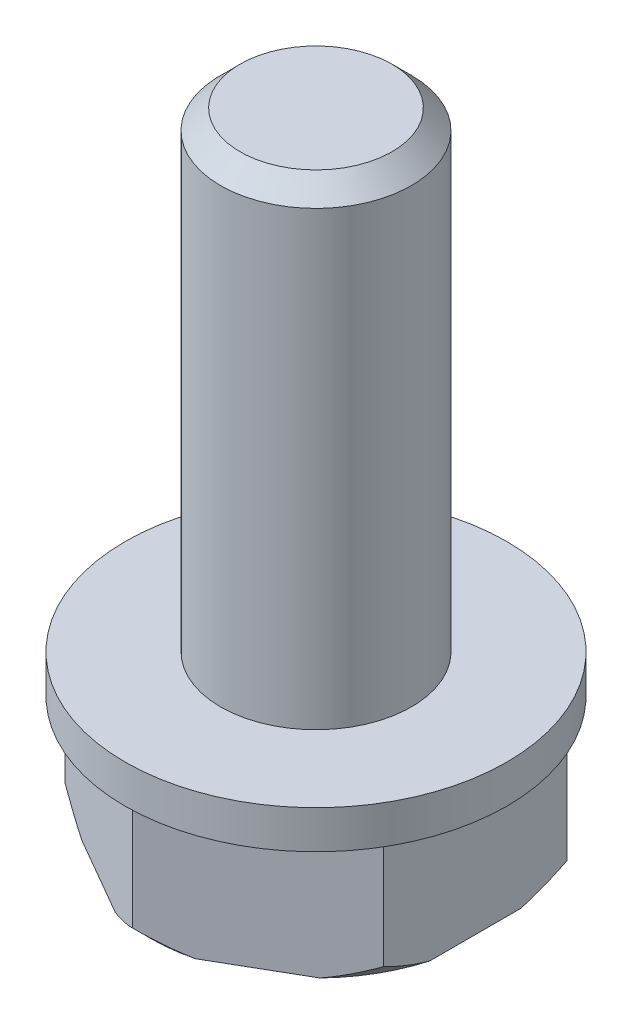
ISO-10303-21;
HEADER;
FILE_DESCRIPTION(('STEP AP214'),'2;1');
FILE_NAME('part.step','',(''),(''),'','','');
FILE_SCHEMA(('AUTOMOTIVE_DESIGN { 1 0 10303 214 1 1 1 1 }'));
ENDSEC;
DATA;
#1=APPLICATION_CONTEXT('core data for automotive mechanical design processes');
#2=APPLICATION_PROTOCOL_DEFINITION('international standard','automotive_design',2000,#1);
#3=PRODUCT_CONTEXT('',#1,'mechanical');
#4=PRODUCT('Part','Part','',(#3));
#5=PRODUCT_RELATED_PRODUCT_CATEGORY('part','',(#4));
#6=PRODUCT_DEFINITION_FORMATION('','',#4);
#7=PRODUCT_DEFINITION_CONTEXT('part definition',#1,'design');
#8=PRODUCT_DEFINITION('design','',#6,#7);
#9=PRODUCT_DEFINITION_SHAPE('','',#8);
#10=(LENGTH_UNIT() NAMED_UNIT(*) SI_UNIT(.MILLI.,.METRE.));
#11=(NAMED_UNIT(*) PLANE_ANGLE_UNIT() SI_UNIT($,.RADIAN.));
#12=(NAMED_UNIT(*) SI_UNIT($,.STERADIAN.) SOLID_ANGLE_UNIT());
#13=UNCERTAINTY_MEASURE_WITH_UNIT(LENGTH_MEASURE(1.E-05),#10,'distance_accuracy_value','');
#14=(GEOMETRIC_REPRESENTATION_CONTEXT(3) GLOBAL_UNCERTAINTY_ASSIGNED_CONTEXT((#13)) GLOBAL_UNIT_ASSIGNED_CONTEXT((#10,
#11,#12)) REPRESENTATION_CONTEXT('',''));
#15=CARTESIAN_POINT('',(0.,0.,0.));
#16=DIRECTION('',(0.,0.,1.));
#17=DIRECTION('',(1.,0.,0.));
#18=AXIS2_PLACEMENT_3D('',#15,#16,#17);
#19=CARTESIAN_POINT('',(22.6776695296637,96.,-20.5644208756118));
#20=DIRECTION('',(-0.5,0.,0.866025403784439));
#21=DIRECTION('',(0.866025403784439,0.,0.5));
#22=AXIS2_PLACEMENT_3D('',#19,#20,#21);
#23=PLANE('',#22);
#24=DIRECTION('',(0.,-1.,0.));
#25=VECTOR('',#24,1.);
#26=CARTESIAN_POINT('',(22.6776695296637,96.,-20.5644208756118));
#27=LINE('',#26,#25);
#28=CARTESIAN_POINT('',(22.6776695296637,50.,-20.5644208756118));
#29=VERTEX_POINT('',#28);
#30=CARTESIAN_POINT('',(22.6776695296637,46.5735026918963,-20.5644208756118));
#31=VERTEX_POINT('',#30);
#32=EDGE_CURVE('E11',#29,#31,#27,.T.);
#33=ORIENTED_EDGE('',*,*,#32,.T.);
#34=CARTESIAN_POINT('',(21.414601217349,46.,-21.2936537057316));
#35=CARTESIAN_POINT('',(21.4664537594648,46.0164440766261,-21.2637151211004));
#36=CARTESIAN_POINT('',(21.5180895158105,46.0337687545802,-21.2338904269128));
#37=CARTESIAN_POINT('',(21.6214874574526,46.0702823086314,-21.1741594018992));
#38=CARTESIAN_POINT('',(21.6732446970938,46.0894897238432,-21.1442558321939));
#39=CARTESIAN_POINT('',(21.7769756621481,46.1297670931507,-21.0843293780453));
#40=CARTESIAN_POINT('',(21.8289432219275,46.1508582920278,-21.054310131997));
#41=CARTESIAN_POINT('',(21.9331790081629,46.1949003649628,-20.9941094242253));
#42=CARTESIAN_POINT('',(21.9854399260141,46.2178745106764,-20.9639323574686));
#43=CARTESIAN_POINT('',(22.0903392794409,46.2656807395659,-20.9033725653862));
#44=CARTESIAN_POINT('',(22.1429693499514,46.2905375181192,-20.8729948770988));
#45=CARTESIAN_POINT('',(22.2486773209186,46.3421079012049,-20.8119895662206));
#46=CARTESIAN_POINT('',(22.3017459168783,46.3688470805479,-20.7813674698508));
#47=CARTESIAN_POINT('',(22.4083946755418,46.4241810640024,-20.7198294215317));
#48=CARTESIAN_POINT('',(22.4619647196343,46.4528018406309,-20.6889193342318));
#49=CARTESIAN_POINT('',(22.56967482855,46.5119007649667,-20.6267615953025));
#50=CARTESIAN_POINT('',(22.6238041115768,46.5424049416879,-20.5955199875061));
#51=CARTESIAN_POINT('',(22.6776695296637,46.5735026918963,-20.5644208756118));
#52=B_SPLINE_CURVE_WITH_KNOTS('',3,(#34,#35,#36,#37,#38,#39,#40,#41,#42,#43,#44,#45,#46,#47,#48,
#49,#50,#51),.UNSPECIFIED.,.F.,.F.,(4,2,2,2,2,2,2,2,4),(0.,0.186265222277086,0.374595608167021,
0.565412784427934,0.759111232115696,0.956057798253864,1.15659171756842,1.36102506604504,
1.56964356219137),.UNSPECIFIED.);
#53=CARTESIAN_POINT('',(21.414601217349,46.,-21.2936537057316));
#54=VERTEX_POINT('',#53);
#55=EDGE_CURVE('E140',#54,#31,#52,.T.);
#56=ORIENTED_EDGE('',*,*,#55,.F.);
#57=DIRECTION('',(0.866025403784439,0.,0.5));
#58=VECTOR('',#57,1.);
#59=CARTESIAN_POINT('',(24.0776695296637,46.,-19.7561304987464));
#60=LINE('',#59,#58);
#61=CARTESIAN_POINT('',(18.9407378419784,46.,-22.7219393914402));
#62=VERTEX_POINT('',#61);
#63=EDGE_CURVE('E158',#62,#54,#60,.T.);
#64=ORIENTED_EDGE('',*,*,#63,.F.);
#65=CARTESIAN_POINT('',(17.6776695296637,46.5735026918963,-23.45117222156));
#66=CARTESIAN_POINT('',(17.7315348596427,46.5424049416879,-23.4200729570583));
#67=CARTESIAN_POINT('',(17.7856555271629,46.5119007649667,-23.3888164267667));
#68=CARTESIAN_POINT('',(17.8933407625753,46.4528018406309,-23.326615605666));
#69=CARTESIAN_POINT('',(17.9468947054565,46.4241810640024,-23.29567763025));
#70=CARTESIAN_POINT('',(18.0535125979319,46.3688470805479,-23.2340861201248));
#71=CARTESIAN_POINT('',(18.1065664092851,46.3421079012049,-23.2034384160655));
#72=CARTESIAN_POINT('',(18.212252543755,46.2905375181192,-23.1423952832645));
#73=CARTESIAN_POINT('',(18.2648754287754,46.2656807395659,-23.1120051493432));
#74=CARTESIAN_POINT('',(18.3697714238801,46.2178745106764,-23.0514395404762));
#75=CARTESIAN_POINT('',(18.4220359892286,46.1949003649628,-23.0212687913703));
#76=CARTESIAN_POINT('',(18.5262892246024,46.1508582920278,-22.9610983063928));
#77=CARTESIAN_POINT('',(18.5782704341725,46.1297670931507,-22.9311027024754));
#78=CARTESIAN_POINT('',(18.682033748351,46.0894897238432,-22.8712322786535));
#79=CARTESIAN_POINT('',(18.7338096192002,46.0702823086314,-22.8413609791471));
#80=CARTESIAN_POINT('',(18.8372371750771,46.0337687545802,-22.7816812474928));
#81=CARTESIAN_POINT('',(18.8888839960765,46.0164440766261,-22.7518757178476));
#82=CARTESIAN_POINT('',(18.9407378419784,46.,-22.7219393914402));
#83=B_SPLINE_CURVE_WITH_KNOTS('',3,(#65,#66,#67,#68,#69,#70,#71,#72,#73,#74,#75,#76,#77,#78,#79,
#80,#81,#82),.UNSPECIFIED.,.F.,.F.,(4,2,2,2,2,2,2,2,4),(0.,0.208618496146344,0.413051844622971,
0.613585763937533,0.810532330075705,1.00423077776347,1.19504795402439,1.38337833991431,
1.56964356219139),.UNSPECIFIED.);
#84=CARTESIAN_POINT('',(17.6776695296637,46.5735026918963,-23.4511722215599));
#85=VERTEX_POINT('',#84);
#86=EDGE_CURVE('E115',#85,#62,#83,.T.);
#87=ORIENTED_EDGE('',*,*,#86,.F.);
#88=DIRECTION('',(0.,-1.,0.));
#89=VECTOR('',#88,1.);
#90=CARTESIAN_POINT('',(17.6776695296637,96.,-23.4511722215599));
#91=LINE('',#90,#89);
#92=CARTESIAN_POINT('',(17.6776695296637,50.,-23.4511722215599));
#93=VERTEX_POINT('',#92);
#94=EDGE_CURVE('E416',#93,#85,#91,.T.);
#95=ORIENTED_EDGE('',*,*,#94,.F.);
#96=DIRECTION('',(-0.866025403784439,0.,-0.5));
#97=VECTOR('',#96,1.);
#98=CARTESIAN_POINT('',(22.4276695296637,50.,-20.7087584429092));
#99=LINE('',#98,#97);
#100=EDGE_CURVE('E384',#29,#93,#99,.T.);
#101=ORIENTED_EDGE('',*,*,#100,.F.);
#102=EDGE_LOOP('',(#33,#56,#64,#87,#95,#101));
#103=FACE_BOUND('',#102,.T.);
#104=ADVANCED_FACE('F16',(#103),#23,.F.);
#105=CARTESIAN_POINT('',(22.6776695296637,96.,-14.7909181837156));
#106=DIRECTION('',(-1.,0.,0.));
#107=DIRECTION('',(0.,0.,1.));
#108=AXIS2_PLACEMENT_3D('',#105,#106,#107);
#109=PLANE('',#108);
#110=DIRECTION('',(0.,-1.,0.));
#111=VECTOR('',#110,1.);
#112=CARTESIAN_POINT('',(22.6776695296637,96.,-14.7909181837156));
#113=LINE('',#112,#111);
#114=CARTESIAN_POINT('',(22.6776695296637,50.,-14.7909181837156));
#115=VERTEX_POINT('',#114);
#116=CARTESIAN_POINT('',(22.6776695296637,46.5735026918963,-14.7909181837156));
#117=VERTEX_POINT('',#116);
#118=EDGE_CURVE('E225',#115,#117,#113,.T.);
#119=ORIENTED_EDGE('',*,*,#118,.T.);
#120=CARTESIAN_POINT('',(22.6776695296637,46.,-16.2493838439551));
#121=CARTESIAN_POINT('',(22.6776682258776,46.0164440766261,-16.1895089329165));
#122=CARTESIAN_POINT('',(22.6776571612239,46.0337687545802,-16.1298787090837));
#123=CARTESIAN_POINT('',(22.6776275469891,46.0702823086314,-16.0104679524158));
#124=CARTESIAN_POINT('',(22.6776089157811,46.0894897238432,-15.9506930832041));
#125=CARTESIAN_POINT('',(22.6775765666569,46.1297670931507,-15.8308962052337));
#126=CARTESIAN_POINT('',(22.6775629168662,46.1508582920278,-15.7708813552678));
#127=CARTESIAN_POINT('',(22.6775454677278,46.1949003649628,-15.6505101625187));
#128=CARTESIAN_POINT('',(22.6775418202304,46.2178745106764,-15.5901623466562));
#129=CARTESIAN_POINT('',(22.6775451785526,46.2656807395659,-15.4690369457068));
#130=CARTESIAN_POINT('',(22.6775523640427,46.2905375181192,-15.4082691234981));
#131=CARTESIAN_POINT('',(22.67757420054,46.3421079012049,-15.2862206798188));
#132=CARTESIAN_POINT('',(22.6775889851464,46.3688470805479,-15.2249508793897));
#133=CARTESIAN_POINT('',(22.6776198513346,46.4241810640024,-15.1018213209455));
#134=CARTESIAN_POINT('',(22.677635952546,46.4528018406309,-15.0399732582295));
#135=CARTESIAN_POINT('',(22.6776608260492,46.5119007649667,-14.9156146981995));
#136=CARTESIAN_POINT('',(22.6776694415558,46.542404941688,-14.8531165601115));
#137=CARTESIAN_POINT('',(22.6776695296637,46.5735026918963,-14.7909181837156));
#138=B_SPLINE_CURVE_WITH_KNOTS('',3,(#120,#121,#122,#123,#124,#125,#126,#127,#128,#129,#130,
#131,#132,#133,#134,#135,#136,#137),.UNSPECIFIED.,.F.,.F.,(4,2,2,2,2,2,2,2,4),(0.,
0.186265222277086,0.374595608167016,0.565412784427928,0.759111232115692,0.956057798253864,
1.15659171756842,1.36102506604504,1.56964356219138),.UNSPECIFIED.);
#139=CARTESIAN_POINT('',(22.6776695296637,46.,-16.2493838439551));
#140=VERTEX_POINT('',#139);
#141=EDGE_CURVE('E29',#140,#117,#138,.T.);
#142=ORIENTED_EDGE('',*,*,#141,.F.);
#143=DIRECTION('',(0.,0.,1.));
#144=VECTOR('',#143,1.);
#145=CARTESIAN_POINT('',(22.6776695296637,46.,-17.6776695296637));
#146=LINE('',#145,#144);
#147=CARTESIAN_POINT('',(22.6776695296637,46.,-19.1059552153723));
#148=VERTEX_POINT('',#147);
#149=EDGE_CURVE('E147',#148,#140,#146,.T.);
#150=ORIENTED_EDGE('',*,*,#149,.F.);
#151=CARTESIAN_POINT('',(22.6776695296637,46.5735026918963,-20.5644208756118));
#152=CARTESIAN_POINT('',(22.6776694415558,46.5424049416879,-20.502222499216));
#153=CARTESIAN_POINT('',(22.6776608260492,46.5119007649667,-20.4397243611279));
#154=CARTESIAN_POINT('',(22.677635952546,46.4528018406309,-20.3153658010979));
#155=CARTESIAN_POINT('',(22.6776198513346,46.4241810640024,-20.2535177383819));
#156=CARTESIAN_POINT('',(22.6775889851464,46.3688470805479,-20.1303881799377));
#157=CARTESIAN_POINT('',(22.67757420054,46.3421079012049,-20.0691183795086));
#158=CARTESIAN_POINT('',(22.6775523640427,46.2905375181192,-19.9470699358293));
#159=CARTESIAN_POINT('',(22.6775451785526,46.2656807395659,-19.8863021136206));
#160=CARTESIAN_POINT('',(22.6775418202304,46.2178745106764,-19.7651767126712));
#161=CARTESIAN_POINT('',(22.6775454677278,46.1949003649628,-19.7048288968087));
#162=CARTESIAN_POINT('',(22.6775629168662,46.1508582920278,-19.5844577040595));
#163=CARTESIAN_POINT('',(22.6775765666568,46.1297670931507,-19.5244428540937));
#164=CARTESIAN_POINT('',(22.6776089157811,46.0894897238432,-19.4046459761233));
#165=CARTESIAN_POINT('',(22.6776275469891,46.0702823086314,-19.3448711069116));
#166=CARTESIAN_POINT('',(22.6776571612239,46.0337687545802,-19.2254603502437));
#167=CARTESIAN_POINT('',(22.6776682258776,46.0164440766261,-19.1658301264109));
#168=CARTESIAN_POINT('',(22.6776695296637,46.,-19.1059552153723));
#169=B_SPLINE_CURVE_WITH_KNOTS('',3,(#151,#152,#153,#154,#155,#156,#157,#158,#159,#160,#161,
#162,#163,#164,#165,#166,#167,#168),.UNSPECIFIED.,.F.,.F.,(4,2,2,2,2,2,2,2,4),(0.,
0.208618496146355,0.41305184462299,0.613585763937555,0.810532330075726,1.00423077776349,
1.19504795402439,1.38337833991431,1.56964356219138),.UNSPECIFIED.);
#170=EDGE_CURVE('E133',#31,#148,#169,.T.);
#171=ORIENTED_EDGE('',*,*,#170,.F.);
#172=ORIENTED_EDGE('',*,*,#32,.F.);
#173=DIRECTION('',(0.,0.,-1.));
#174=VECTOR('',#173,1.);
#175=CARTESIAN_POINT('',(22.6776695296637,50.,-17.6776695296637));
#176=LINE('',#175,#174);
#177=EDGE_CURVE('E382',#115,#29,#176,.T.);
#178=ORIENTED_EDGE('',*,*,#177,.F.);
#179=EDGE_LOOP('',(#119,#142,#150,#171,#172,#178));
#180=FACE_BOUND('',#179,.T.);
#181=ADVANCED_FACE('F149',(#180),#109,.F.);
#182=CARTESIAN_POINT('',(17.6776695296637,46.8,-17.6776695296637));
#183=DIRECTION('',(0.,1.,0.));
#184=DIRECTION('',(0.,0.,1.));
#185=AXIS2_PLACEMENT_3D('',#182,#183,#184);
#186=CONICAL_SURFACE('',#185,6.,0.785398163397448);
#187=CARTESIAN_POINT('',(17.6776695296637,46.,-17.6776695296637));
#188=DIRECTION('',(0.,-1.,0.));
#189=DIRECTION('',(0.,0.,-1.));
#190=AXIS2_PLACEMENT_3D('',#187,#188,#189);
#191=CIRCLE('',#190,5.2);
#192=CARTESIAN_POINT('',(21.414601217349,46.,-14.0616853535958));
#193=VERTEX_POINT('',#192);
#194=EDGE_CURVE('E153',#140,#193,#191,.T.);
#195=ORIENTED_EDGE('',*,*,#194,.F.);
#196=ORIENTED_EDGE('',*,*,#141,.T.);
#197=CARTESIAN_POINT('',(22.6776695296637,46.5735026918963,-14.7909181837156));
#198=CARTESIAN_POINT('',(22.6238041115768,46.5424049416879,-14.7598190718213));
#199=CARTESIAN_POINT('',(22.56967482855,46.5119007649667,-14.7285774640249));
#200=CARTESIAN_POINT('',(22.4619647196343,46.4528018406309,-14.6664197250956));
#201=CARTESIAN_POINT('',(22.4083946755418,46.4241810640024,-14.6355096377956));
#202=CARTESIAN_POINT('',(22.3017459168782,46.3688470805479,-14.5739715894766));
#203=CARTESIAN_POINT('',(22.2486773209186,46.3421079012049,-14.5433494931068));
#204=CARTESIAN_POINT('',(22.1429693499514,46.2905375181192,-14.4823441822286));
#205=CARTESIAN_POINT('',(22.0903392794409,46.2656807395659,-14.4519664939412));
#206=CARTESIAN_POINT('',(21.9854399260141,46.2178745106764,-14.3914067018588));
#207=CARTESIAN_POINT('',(21.9331790081629,46.1949003649628,-14.3612296351021));
#208=CARTESIAN_POINT('',(21.8289432219275,46.1508582920278,-14.3010289273304));
#209=CARTESIAN_POINT('',(21.7769756621481,46.1297670931507,-14.2710096812821));
#210=CARTESIAN_POINT('',(21.6732446970938,46.0894897238432,-14.2110832271335));
#211=CARTESIAN_POINT('',(21.6214874574526,46.0702823086314,-14.1811796574282));
#212=CARTESIAN_POINT('',(21.5180895158105,46.0337687545802,-14.1214486324146));
#213=CARTESIAN_POINT('',(21.4664537594648,46.0164440766261,-14.091623938227));
#214=CARTESIAN_POINT('',(21.414601217349,46.,-14.0616853535958));
#215=B_SPLINE_CURVE_WITH_KNOTS('',3,(#197,#198,#199,#200,#201,#202,#203,#204,#205,#206,#207,
#208,#209,#210,#211,#212,#213,#214),.UNSPECIFIED.,.F.,.F.,(4,2,2,2,2,2,2,2,4),(0.,
0.208618496146345,0.41305184462297,0.613585763937533,0.810532330075701,1.00423077776346,
1.19504795402437,1.3833783399143,1.56964356219138),.UNSPECIFIED.);
#216=EDGE_CURVE('E227',#117,#193,#215,.T.);
#217=ORIENTED_EDGE('',*,*,#216,.T.);
#218=EDGE_LOOP('',(#195,#196,#217));
#219=FACE_BOUND('',#218,.T.);
#220=ADVANCED_FACE('F182',(#219),#186,.T.);
#221=CARTESIAN_POINT('',(17.6776695296637,46.8,-17.6776695296637));
#222=DIRECTION('',(0.,1.,0.));
#223=DIRECTION('',(0.,0.,1.));
#224=AXIS2_PLACEMENT_3D('',#221,#222,#223);
#225=CONICAL_SURFACE('',#224,6.,0.785398163397448);
#226=CARTESIAN_POINT('',(17.6776695296637,46.,-17.6776695296637));
#227=DIRECTION('',(0.,-1.,0.));
#228=DIRECTION('',(0.,0.,-1.));
#229=AXIS2_PLACEMENT_3D('',#226,#227,#228);
#230=CIRCLE('',#229,5.2);
#231=EDGE_CURVE('E138',#54,#148,#230,.T.);
#232=ORIENTED_EDGE('',*,*,#231,.F.);
#233=ORIENTED_EDGE('',*,*,#55,.T.);
#234=ORIENTED_EDGE('',*,*,#170,.T.);
#235=EDGE_LOOP('',(#232,#233,#234));
#236=FACE_BOUND('',#235,.T.);
#237=ADVANCED_FACE('F136',(#236),#225,.T.);
#238=CARTESIAN_POINT('',(17.6776695296637,46.8,-17.6776695296637));
#239=DIRECTION('',(0.,1.,0.));
#240=DIRECTION('',(0.,0.,1.));
#241=AXIS2_PLACEMENT_3D('',#238,#239,#240);
#242=CONICAL_SURFACE('',#241,6.,0.785398163397448);
#243=CARTESIAN_POINT('',(17.6776695296637,46.,-17.6776695296637));
#244=DIRECTION('',(0.,-1.,0.));
#245=DIRECTION('',(0.,0.,-1.));
#246=AXIS2_PLACEMENT_3D('',#243,#244,#245);
#247=CIRCLE('',#246,5.2);
#248=CARTESIAN_POINT('',(16.414601217349,46.,-22.7219393914402));
#249=VERTEX_POINT('',#248);
#250=EDGE_CURVE('E160',#249,#62,#247,.T.);
#251=ORIENTED_EDGE('',*,*,#250,.F.);
#252=CARTESIAN_POINT('',(16.414601217349,46.,-22.7219393914402));
#253=CARTESIAN_POINT('',(16.4664550632509,46.0164440766261,-22.7518757178476));
#254=CARTESIAN_POINT('',(16.5181018842503,46.0337687545802,-22.7816812474928));
#255=CARTESIAN_POINT('',(16.6215294401272,46.0702823086314,-22.8413609791471));
#256=CARTESIAN_POINT('',(16.6733053109764,46.0894897238432,-22.8712322786535));
#257=CARTESIAN_POINT('',(16.777068625155,46.1297670931507,-22.9311027024754));
#258=CARTESIAN_POINT('',(16.829049834725,46.1508582920278,-22.9610983063928));
#259=CARTESIAN_POINT('',(16.9333030700988,46.1949003649628,-23.0212687913703));
#260=CARTESIAN_POINT('',(16.9855676354474,46.2178745106764,-23.0514395404762));
#261=CARTESIAN_POINT('',(17.090463630552,46.2656807395659,-23.1120051493432));
#262=CARTESIAN_POINT('',(17.1430865155724,46.2905375181192,-23.1423952832645));
#263=CARTESIAN_POINT('',(17.2487726500423,46.3421079012049,-23.2034384160655));
#264=CARTESIAN_POINT('',(17.3018264613955,46.3688470805479,-23.2340861201248));
#265=CARTESIAN_POINT('',(17.4084443538709,46.4241810640024,-23.29567763025));
#266=CARTESIAN_POINT('',(17.4619982967521,46.4528018406309,-23.326615605666));
#267=CARTESIAN_POINT('',(17.5696835321645,46.5119007649667,-23.3888164267667));
#268=CARTESIAN_POINT('',(17.6238041996847,46.5424049416879,-23.4200729570583));
#269=CARTESIAN_POINT('',(17.6776695296637,46.5735026918963,-23.45117222156));
#270=B_SPLINE_CURVE_WITH_KNOTS('',3,(#252,#253,#254,#255,#256,#257,#258,#259,#260,#261,#262,
#263,#264,#265,#266,#267,#268,#269),.UNSPECIFIED.,.F.,.F.,(4,2,2,2,2,2,2,2,4),(0.,
0.186265222277085,0.37459560816702,0.565412784427932,0.759111232115701,0.956057798253871,
1.15659171756843,1.36102506604505,1.56964356219139),.UNSPECIFIED.);
#271=EDGE_CURVE('E424',#249,#85,#270,.T.);
#272=ORIENTED_EDGE('',*,*,#271,.T.);
#273=ORIENTED_EDGE('',*,*,#86,.T.);
#274=EDGE_LOOP('',(#251,#272,#273));
#275=FACE_BOUND('',#274,.T.);
#276=ADVANCED_FACE('F181',(#275),#242,.T.);
#277=CARTESIAN_POINT('',(17.6776695296637,51.2,-17.6776695296637));
#278=DIRECTION('',(0.,-1.,0.));
#279=DIRECTION('',(0.,0.,-1.));
#280=AXIS2_PLACEMENT_3D('',#277,#278,#279);
#281=PLANE('',#280);
#282=CARTESIAN_POINT('',(17.6776695296637,51.2,-17.6776695296637));
#283=DIRECTION('',(0.,-1.,0.));
#284=DIRECTION('',(0.,0.,-1.));
#285=AXIS2_PLACEMENT_3D('',#282,#283,#284);
#286=CIRCLE('',#285,3.);
#287=CARTESIAN_POINT('',(17.6776695296637,51.2,-20.6776695296637));
#288=VERTEX_POINT('',#287);
#289=EDGE_CURVE('E100',#288,#288,#286,.T.);
#290=ORIENTED_EDGE('',*,*,#289,.T.);
#291=EDGE_LOOP('',(#290));
#292=FACE_BOUND('',#291,.T.);
#293=CARTESIAN_POINT('',(17.6776695296637,51.2,-17.6776695296637));
#294=DIRECTION('',(0.,-1.,0.));
#295=DIRECTION('',(0.,0.,-1.));
#296=AXIS2_PLACEMENT_3D('',#293,#294,#295);
#297=CIRCLE('',#296,6.);
#298=CARTESIAN_POINT('',(17.6776695296637,51.2,-23.6776695296637));
#299=VERTEX_POINT('',#298);
#300=EDGE_CURVE('E493',#299,#299,#297,.T.);
#301=ORIENTED_EDGE('',*,*,#300,.F.);
#302=EDGE_LOOP('',(#301));
#303=FACE_BOUND('',#302,.T.);
#304=ADVANCED_FACE('F405',(#292,#303),#281,.F.);
#305=CARTESIAN_POINT('',(17.6776695296637,46.8,-17.6776695296637));
#306=DIRECTION('',(0.,1.,0.));
#307=DIRECTION('',(0.,0.,1.));
#308=AXIS2_PLACEMENT_3D('',#305,#306,#307);
#309=CONICAL_SURFACE('',#308,6.,0.785398163397448);
#310=CARTESIAN_POINT('',(17.6776695296637,46.,-17.6776695296637));
#311=DIRECTION('',(0.,-1.,0.));
#312=DIRECTION('',(0.,0.,-1.));
#313=AXIS2_PLACEMENT_3D('',#310,#311,#312);
#314=CIRCLE('',#313,5.2);
#315=CARTESIAN_POINT('',(12.6776695296637,46.,-19.1059552153723));
#316=VERTEX_POINT('',#315);
#317=CARTESIAN_POINT('',(13.9407378419784,46.,-21.2936537057316));
#318=VERTEX_POINT('',#317);
#319=EDGE_CURVE('E459',#316,#318,#314,.T.);
#320=ORIENTED_EDGE('',*,*,#319,.F.);
#321=CARTESIAN_POINT('',(12.6776695296637,46.,-19.1059552153723));
#322=CARTESIAN_POINT('',(12.6776708334498,46.0164440766261,-19.165830126411));
#323=CARTESIAN_POINT('',(12.6776818981035,46.0337687545802,-19.2254603502438));
#324=CARTESIAN_POINT('',(12.6777115123383,46.0702823086314,-19.3448711069116));
#325=CARTESIAN_POINT('',(12.6777301435463,46.0894897238432,-19.4046459761234));
#326=CARTESIAN_POINT('',(12.6777624926705,46.1297670931507,-19.5244428540937));
#327=CARTESIAN_POINT('',(12.6777761424612,46.1508582920278,-19.5844577040596));
#328=CARTESIAN_POINT('',(12.6777935915996,46.1949003649628,-19.7048288968087));
#329=CARTESIAN_POINT('',(12.677797239097,46.2178745106764,-19.7651767126713));
#330=CARTESIAN_POINT('',(12.6777938807748,46.2656807395659,-19.8863021136206));
#331=CARTESIAN_POINT('',(12.6777866952847,46.2905375181192,-19.9470699358293));
#332=CARTESIAN_POINT('',(12.6777648587874,46.3421079012049,-20.0691183795086));
#333=CARTESIAN_POINT('',(12.677750074181,46.3688470805479,-20.1303881799377));
#334=CARTESIAN_POINT('',(12.6777192079928,46.4241810640024,-20.2535177383819));
#335=CARTESIAN_POINT('',(12.6777031067814,46.4528018406309,-20.3153658010979));
#336=CARTESIAN_POINT('',(12.6776782332782,46.5119007649667,-20.4397243611279));
#337=CARTESIAN_POINT('',(12.6776696177716,46.542404941688,-20.502222499216));
#338=CARTESIAN_POINT('',(12.6776695296637,46.5735026918963,-20.5644208756118));
#339=B_SPLINE_CURVE_WITH_KNOTS('',3,(#321,#322,#323,#324,#325,#326,#327,#328,#329,#330,#331,
#332,#333,#334,#335,#336,#337,#338),.UNSPECIFIED.,.F.,.F.,(4,2,2,2,2,2,2,2,4),(0.,
0.186265222277079,0.37459560816701,0.565412784427918,0.759111232115676,0.956057798253847,
1.15659171756841,1.36102506604503,1.56964356219137),.UNSPECIFIED.);
#340=CARTESIAN_POINT('',(12.6776695296637,46.5735026918963,-20.5644208756118));
#341=VERTEX_POINT('',#340);
#342=EDGE_CURVE('E425',#316,#341,#339,.T.);
#343=ORIENTED_EDGE('',*,*,#342,.T.);
#344=CARTESIAN_POINT('',(12.6776695296637,46.5735026918963,-20.5644208756118));
#345=CARTESIAN_POINT('',(12.7315349477506,46.5424049416879,-20.5955199875061));
#346=CARTESIAN_POINT('',(12.7856642307775,46.5119007649667,-20.6267615953026));
#347=CARTESIAN_POINT('',(12.8933743396931,46.4528018406309,-20.6889193342319));
#348=CARTESIAN_POINT('',(12.9469443837857,46.4241810640024,-20.7198294215318));
#349=CARTESIAN_POINT('',(13.0535931424492,46.3688470805479,-20.7813674698508));
#350=CARTESIAN_POINT('',(13.1066617384088,46.3421079012049,-20.8119895662206));
#351=CARTESIAN_POINT('',(13.212369709376,46.2905375181192,-20.8729948770988));
#352=CARTESIAN_POINT('',(13.2649997798865,46.2656807395659,-20.9033725653862));
#353=CARTESIAN_POINT('',(13.3698991333133,46.2178745106764,-20.9639323574686));
#354=CARTESIAN_POINT('',(13.4221600511645,46.1949003649628,-20.9941094242253));
#355=CARTESIAN_POINT('',(13.5263958373999,46.1508582920278,-21.054310131997));
#356=CARTESIAN_POINT('',(13.5783633971793,46.1297670931507,-21.0843293780454));
#357=CARTESIAN_POINT('',(13.6820943622336,46.0894897238432,-21.1442558321939));
#358=CARTESIAN_POINT('',(13.7338516018749,46.0702823086314,-21.1741594018992));
#359=CARTESIAN_POINT('',(13.8372495435169,46.0337687545802,-21.2338904269128));
#360=CARTESIAN_POINT('',(13.8888852998626,46.0164440766261,-21.2637151211004));
#361=CARTESIAN_POINT('',(13.9407378419784,46.,-21.2936537057316));
#362=B_SPLINE_CURVE_WITH_KNOTS('',3,(#344,#345,#346,#347,#348,#349,#350,#351,#352,#353,#354,
#355,#356,#357,#358,#359,#360,#361),.UNSPECIFIED.,.F.,.F.,(4,2,2,2,2,2,2,2,4),(0.,
0.208618496146345,0.41305184462297,0.61358576393753,0.810532330075701,1.00423077776346,
1.19504795402437,1.3833783399143,1.56964356219137),.UNSPECIFIED.);
#363=EDGE_CURVE('E124',#341,#318,#362,.T.);
#364=ORIENTED_EDGE('',*,*,#363,.T.);
#365=EDGE_LOOP('',(#320,#343,#364));
#366=FACE_BOUND('',#365,.T.);
#367=ADVANCED_FACE('F308',(#366),#309,.T.);
#368=CARTESIAN_POINT('',(17.6776695296637,50.,-17.6776695296637));
#369=DIRECTION('',(0.,-1.,0.));
#370=DIRECTION('',(0.,0.,-1.));
#371=AXIS2_PLACEMENT_3D('',#368,#369,#370);
#372=CYLINDRICAL_SURFACE('',#371,6.);
#373=ORIENTED_EDGE('',*,*,#300,.T.);
#374=EDGE_LOOP('',(#373));
#375=FACE_BOUND('',#374,.T.);
#376=CARTESIAN_POINT('',(17.6776695296637,50.,-17.6776695296637));
#377=DIRECTION('',(0.,-1.,0.));
#378=DIRECTION('',(0.,0.,-1.));
#379=AXIS2_PLACEMENT_3D('',#376,#377,#378);
#380=CIRCLE('',#379,6.);
#381=CARTESIAN_POINT('',(17.6776695296637,50.,-23.6776695296637));
#382=VERTEX_POINT('',#381);
#383=EDGE_CURVE('E454',#382,#382,#380,.T.);
#384=ORIENTED_EDGE('',*,*,#383,.F.);
#385=EDGE_LOOP('',(#384));
#386=FACE_BOUND('',#385,.T.);
#387=ADVANCED_FACE('F527',(#375,#386),#372,.T.);
#388=CARTESIAN_POINT('',(17.6776695296637,96.,-23.4511722215599));
#389=DIRECTION('',(0.5,0.,0.866025403784439));
#390=DIRECTION('',(0.866025403784439,0.,-0.5));
#391=AXIS2_PLACEMENT_3D('',#388,#389,#390);
#392=PLANE('',#391);
#393=ORIENTED_EDGE('',*,*,#94,.T.);
#394=ORIENTED_EDGE('',*,*,#271,.F.);
#395=DIRECTION('',(0.866025403784439,0.,-0.5));
#396=VECTOR('',#395,1.);
#397=CARTESIAN_POINT('',(19.0776695296637,46.,-24.2594625984254));
#398=LINE('',#397,#396);
#399=EDGE_CURVE('E429',#318,#249,#398,.T.);
#400=ORIENTED_EDGE('',*,*,#399,.F.);
#401=ORIENTED_EDGE('',*,*,#363,.F.);
#402=DIRECTION('',(0.,-1.,0.));
#403=VECTOR('',#402,1.);
#404=CARTESIAN_POINT('',(12.6776695296637,96.,-20.5644208756118));
#405=LINE('',#404,#403);
#406=CARTESIAN_POINT('',(12.6776695296637,50.,-20.5644208756118));
#407=VERTEX_POINT('',#406);
#408=EDGE_CURVE('E446',#407,#341,#405,.T.);
#409=ORIENTED_EDGE('',*,*,#408,.F.);
#410=DIRECTION('',(-0.866025403784439,0.,0.5));
#411=VECTOR('',#410,1.);
#412=CARTESIAN_POINT('',(17.4276695296637,50.,-23.3068346542625));
#413=LINE('',#412,#411);
#414=EDGE_CURVE('E358',#93,#407,#413,.T.);
#415=ORIENTED_EDGE('',*,*,#414,.F.);
#416=EDGE_LOOP('',(#393,#394,#400,#401,#409,#415));
#417=FACE_BOUND('',#416,.T.);
#418=ADVANCED_FACE('F18',(#417),#392,.F.);
#419=CARTESIAN_POINT('',(12.6776695296637,96.,-20.5644208756118));
#420=DIRECTION('',(1.,0.,0.));
#421=DIRECTION('',(0.,0.,-1.));
#422=AXIS2_PLACEMENT_3D('',#419,#420,#421);
#423=PLANE('',#422);
#424=ORIENTED_EDGE('',*,*,#408,.T.);
#425=ORIENTED_EDGE('',*,*,#342,.F.);
#426=DIRECTION('',(0.,0.,-1.));
#427=VECTOR('',#426,1.);
#428=CARTESIAN_POINT('',(12.6776695296637,46.,-17.6776695296637));
#429=LINE('',#428,#427);
#430=CARTESIAN_POINT('',(12.6776695296637,46.,-16.2493838439551));
#431=VERTEX_POINT('',#430);
#432=EDGE_CURVE('E340',#431,#316,#429,.T.);
#433=ORIENTED_EDGE('',*,*,#432,.F.);
#434=CARTESIAN_POINT('',(12.6776695296637,46.5735026918963,-14.7909181837156));
#435=CARTESIAN_POINT('',(12.6776696177716,46.5424049416879,-14.8531165601114));
#436=CARTESIAN_POINT('',(12.6776782332782,46.5119007649667,-14.9156146981995));
#437=CARTESIAN_POINT('',(12.6777031067814,46.4528018406309,-15.0399732582295));
#438=CARTESIAN_POINT('',(12.6777192079928,46.4241810640024,-15.1018213209455));
#439=CARTESIAN_POINT('',(12.677750074181,46.3688470805479,-15.2249508793897));
#440=CARTESIAN_POINT('',(12.6777648587874,46.3421079012049,-15.2862206798188));
#441=CARTESIAN_POINT('',(12.6777866952847,46.2905375181192,-15.4082691234981));
#442=CARTESIAN_POINT('',(12.6777938807748,46.2656807395659,-15.4690369457068));
#443=CARTESIAN_POINT('',(12.677797239097,46.2178745106764,-15.5901623466562));
#444=CARTESIAN_POINT('',(12.6777935915996,46.1949003649628,-15.6505101625188));
#445=CARTESIAN_POINT('',(12.6777761424612,46.1508582920278,-15.7708813552679));
#446=CARTESIAN_POINT('',(12.6777624926706,46.1297670931507,-15.8308962052337));
#447=CARTESIAN_POINT('',(12.6777301435463,46.0894897238432,-15.9506930832041));
#448=CARTESIAN_POINT('',(12.6777115123383,46.0702823086314,-16.0104679524158));
#449=CARTESIAN_POINT('',(12.6776818981035,46.0337687545802,-16.1298787090837));
#450=CARTESIAN_POINT('',(12.6776708334498,46.0164440766261,-16.1895089329164));
#451=CARTESIAN_POINT('',(12.6776695296637,46.,-16.2493838439551));
#452=B_SPLINE_CURVE_WITH_KNOTS('',3,(#434,#435,#436,#437,#438,#439,#440,#441,#442,#443,#444,
#445,#446,#447,#448,#449,#450,#451),.UNSPECIFIED.,.F.,.F.,(4,2,2,2,2,2,2,2,4),(0.,
0.208618496146364,0.413051844623001,0.613585763937566,0.810532330075742,1.0042307777635,
1.1950479540244,1.38337833991432,1.56964356219138),.UNSPECIFIED.);
#453=CARTESIAN_POINT('',(12.6776695296637,46.5735026918963,-14.7909181837156));
#454=VERTEX_POINT('',#453);
#455=EDGE_CURVE('E280',#454,#431,#452,.T.);
#456=ORIENTED_EDGE('',*,*,#455,.F.);
#457=DIRECTION('',(0.,-1.,0.));
#458=VECTOR('',#457,1.);
#459=CARTESIAN_POINT('',(12.6776695296637,96.,-14.7909181837156));
#460=LINE('',#459,#458);
#461=CARTESIAN_POINT('',(12.6776695296637,50.,-14.7909181837156));
#462=VERTEX_POINT('',#461);
#463=EDGE_CURVE('E233',#462,#454,#460,.T.);
#464=ORIENTED_EDGE('',*,*,#463,.F.);
#465=DIRECTION('',(0.,0.,1.));
#466=VECTOR('',#465,1.);
#467=CARTESIAN_POINT('',(12.6776695296637,50.,-17.6776695296637));
#468=LINE('',#467,#466);
#469=EDGE_CURVE('E502',#407,#462,#468,.T.);
#470=ORIENTED_EDGE('',*,*,#469,.F.);
#471=EDGE_LOOP('',(#424,#425,#433,#456,#464,#470));
#472=FACE_BOUND('',#471,.T.);
#473=ADVANCED_FACE('F183',(#472),#423,.F.);
#474=CARTESIAN_POINT('',(23.6776695296637,50.,-17.6776695296637));
#475=DIRECTION('',(0.,1.,0.));
#476=DIRECTION('',(0.,0.,1.));
#477=AXIS2_PLACEMENT_3D('',#474,#475,#476);
#478=PLANE('',#477);
#479=ORIENTED_EDGE('',*,*,#383,.T.);
#480=EDGE_LOOP('',(#479));
#481=FACE_BOUND('',#480,.T.);
#482=ORIENTED_EDGE('',*,*,#177,.T.);
#483=ORIENTED_EDGE('',*,*,#100,.T.);
#484=ORIENTED_EDGE('',*,*,#414,.T.);
#485=ORIENTED_EDGE('',*,*,#469,.T.);
#486=DIRECTION('',(0.866025403784439,0.,0.5));
#487=VECTOR('',#486,1.);
#488=CARTESIAN_POINT('',(17.4276695296637,50.,-12.0485044050648));
#489=LINE('',#488,#487);
#490=CARTESIAN_POINT('',(17.6776695296637,50.,-11.9041668377674));
#491=VERTEX_POINT('',#490);
#492=EDGE_CURVE('E341',#462,#491,#489,.T.);
#493=ORIENTED_EDGE('',*,*,#492,.T.);
#494=DIRECTION('',(0.866025403784439,0.,-0.5));
#495=VECTOR('',#494,1.);
#496=CARTESIAN_POINT('',(22.4276695296637,50.,-14.6465806164181));
#497=LINE('',#496,#495);
#498=EDGE_CURVE('E226',#491,#115,#497,.T.);
#499=ORIENTED_EDGE('',*,*,#498,.T.);
#500=EDGE_LOOP('',(#482,#483,#484,#485,#493,#499));
#501=FACE_BOUND('',#500,.T.);
#502=ADVANCED_FACE('F387',(#481,#501),#478,.F.);
#503=CARTESIAN_POINT('',(17.6776695296637,66.,-17.6776695296637));
#504=DIRECTION('',(0.,-1.,0.));
#505=DIRECTION('',(0.,0.,-1.));
#506=AXIS2_PLACEMENT_3D('',#503,#504,#505);
#507=CONICAL_SURFACE('',#506,2.3865,0.785398163397446);
#508=CARTESIAN_POINT('',(17.6776695296637,66.,-17.6776695296637));
#509=DIRECTION('',(0.,-1.,0.));
#510=DIRECTION('',(0.,0.,-1.));
#511=AXIS2_PLACEMENT_3D('',#508,#509,#510);
#512=CIRCLE('',#511,2.3865);
#513=CARTESIAN_POINT('',(17.6776695296637,66.,-20.0641695296637));
#514=VERTEX_POINT('',#513);
#515=EDGE_CURVE('E385',#514,#514,#512,.T.);
#516=ORIENTED_EDGE('',*,*,#515,.T.);
#517=EDGE_LOOP('',(#516));
#518=FACE_BOUND('',#517,.T.);
#519=CARTESIAN_POINT('',(17.6776695296637,65.3865,-17.6776695296637));
#520=DIRECTION('',(0.,-1.,0.));
#521=DIRECTION('',(0.,0.,-1.));
#522=AXIS2_PLACEMENT_3D('',#519,#520,#521);
#523=CIRCLE('',#522,3.);
#524=CARTESIAN_POINT('',(17.6776695296637,65.3865,-20.6776695296637));
#525=VERTEX_POINT('',#524);
#526=EDGE_CURVE('E94',#525,#525,#523,.T.);
#527=ORIENTED_EDGE('',*,*,#526,.F.);
#528=EDGE_LOOP('',(#527));
#529=FACE_BOUND('',#528,.T.);
#530=ADVANCED_FACE('F389',(#518,#529),#507,.T.);
#531=CARTESIAN_POINT('',(17.6776695296637,66.,-17.6776695296637));
#532=DIRECTION('',(0.,-1.,0.));
#533=DIRECTION('',(0.,0.,-1.));
#534=AXIS2_PLACEMENT_3D('',#531,#532,#533);
#535=PLANE('',#534);
#536=ORIENTED_EDGE('',*,*,#515,.F.);
#537=EDGE_LOOP('',(#536));
#538=FACE_BOUND('',#537,.T.);
#539=ADVANCED_FACE('F396',(#538),#535,.F.);
#540=CARTESIAN_POINT('',(17.6776695296637,46.,-17.6776695296637));
#541=DIRECTION('',(0.,-1.,0.));
#542=DIRECTION('',(0.,0.,-1.));
#543=AXIS2_PLACEMENT_3D('',#540,#541,#542);
#544=CYLINDRICAL_SURFACE('',#543,3.);
#545=ORIENTED_EDGE('',*,*,#526,.T.);
#546=EDGE_LOOP('',(#545));
#547=FACE_BOUND('',#546,.T.);
#548=ORIENTED_EDGE('',*,*,#289,.F.);
#549=EDGE_LOOP('',(#548));
#550=FACE_BOUND('',#549,.T.);
#551=ADVANCED_FACE('F407',(#547,#550),#544,.T.);
#552=CARTESIAN_POINT('',(17.6776695296637,46.8,-17.6776695296637));
#553=DIRECTION('',(0.,1.,0.));
#554=DIRECTION('',(0.,0.,1.));
#555=AXIS2_PLACEMENT_3D('',#552,#553,#554);
#556=CONICAL_SURFACE('',#555,6.,0.785398163397448);
#557=CARTESIAN_POINT('',(17.6776695296637,46.,-17.6776695296637));
#558=DIRECTION('',(0.,-1.,0.));
#559=DIRECTION('',(0.,0.,-1.));
#560=AXIS2_PLACEMENT_3D('',#557,#558,#559);
#561=CIRCLE('',#560,5.2);
#562=CARTESIAN_POINT('',(18.9407378419784,46.,-12.6333996678872));
#563=VERTEX_POINT('',#562);
#564=CARTESIAN_POINT('',(16.414601217349,46.,-12.6333996678872));
#565=VERTEX_POINT('',#564);
#566=EDGE_CURVE('E220',#563,#565,#561,.T.);
#567=ORIENTED_EDGE('',*,*,#566,.F.);
#568=CARTESIAN_POINT('',(18.9407378419784,46.,-12.6333996678872));
#569=CARTESIAN_POINT('',(18.8888839960765,46.0164440766261,-12.6034633414798));
#570=CARTESIAN_POINT('',(18.8372371750771,46.0337687545802,-12.5736578118346));
#571=CARTESIAN_POINT('',(18.7338096192002,46.0702823086314,-12.5139780801803));
#572=CARTESIAN_POINT('',(18.682033748351,46.0894897238432,-12.4841067806739));
#573=CARTESIAN_POINT('',(18.5782704341724,46.1297670931507,-12.424236356852));
#574=CARTESIAN_POINT('',(18.5262892246024,46.1508582920278,-12.3942407529346));
#575=CARTESIAN_POINT('',(18.4220359892286,46.1949003649628,-12.3340702679571));
#576=CARTESIAN_POINT('',(18.36977142388,46.2178745106764,-12.3038995188512));
#577=CARTESIAN_POINT('',(18.2648754287754,46.2656807395659,-12.2433339099843));
#578=CARTESIAN_POINT('',(18.212252543755,46.2905375181192,-12.2129437760629));
#579=CARTESIAN_POINT('',(18.1065664092851,46.3421079012049,-12.1519006432619));
#580=CARTESIAN_POINT('',(18.0535125979319,46.3688470805479,-12.1212529392026));
#581=CARTESIAN_POINT('',(17.9468947054565,46.4241810640024,-12.0596614290774));
#582=CARTESIAN_POINT('',(17.8933407625753,46.4528018406309,-12.0287234536614));
#583=CARTESIAN_POINT('',(17.7856555271629,46.5119007649667,-11.9665226325607));
#584=CARTESIAN_POINT('',(17.7315348596427,46.5424049416879,-11.9352661022691));
#585=CARTESIAN_POINT('',(17.6776695296637,46.5735026918963,-11.9041668377675));
#586=B_SPLINE_CURVE_WITH_KNOTS('',3,(#568,#569,#570,#571,#572,#573,#574,#575,#576,#577,#578,
#579,#580,#581,#582,#583,#584,#585),.UNSPECIFIED.,.F.,.F.,(4,2,2,2,2,2,2,2,4),(0.,
0.186265222277083,0.374595608167015,0.565412784427929,0.759111232115691,0.956057798253859,
1.15659171756841,1.36102506604504,1.56964356219137),.UNSPECIFIED.);
#587=CARTESIAN_POINT('',(17.6776695296637,46.5735026918963,-11.9041668377674));
#588=VERTEX_POINT('',#587);
#589=EDGE_CURVE('E241',#563,#588,#586,.T.);
#590=ORIENTED_EDGE('',*,*,#589,.T.);
#591=CARTESIAN_POINT('',(17.6776695296637,46.5735026918963,-11.9041668377674));
#592=CARTESIAN_POINT('',(17.6238041996847,46.5424049416879,-11.9352661022691));
#593=CARTESIAN_POINT('',(17.5696835321645,46.5119007649667,-11.9665226325607));
#594=CARTESIAN_POINT('',(17.4619982967521,46.4528018406309,-12.0287234536614));
#595=CARTESIAN_POINT('',(17.4084443538709,46.4241810640024,-12.0596614290774));
#596=CARTESIAN_POINT('',(17.3018264613955,46.3688470805479,-12.1212529392026));
#597=CARTESIAN_POINT('',(17.2487726500423,46.3421079012049,-12.1519006432619));
#598=CARTESIAN_POINT('',(17.1430865155724,46.2905375181192,-12.2129437760629));
#599=CARTESIAN_POINT('',(17.090463630552,46.2656807395659,-12.2433339099843));
#600=CARTESIAN_POINT('',(16.9855676354474,46.2178745106764,-12.3038995188512));
#601=CARTESIAN_POINT('',(16.9333030700988,46.1949003649628,-12.3340702679571));
#602=CARTESIAN_POINT('',(16.829049834725,46.1508582920278,-12.3942407529346));
#603=CARTESIAN_POINT('',(16.777068625155,46.1297670931507,-12.424236356852));
#604=CARTESIAN_POINT('',(16.6733053109764,46.0894897238432,-12.4841067806739));
#605=CARTESIAN_POINT('',(16.6215294401272,46.0702823086314,-12.5139780801803));
#606=CARTESIAN_POINT('',(16.5181018842503,46.0337687545802,-12.5736578118346));
#607=CARTESIAN_POINT('',(16.4664550632509,46.0164440766261,-12.6034633414798));
#608=CARTESIAN_POINT('',(16.414601217349,46.,-12.6333996678872));
#609=B_SPLINE_CURVE_WITH_KNOTS('',3,(#591,#592,#593,#594,#595,#596,#597,#598,#599,#600,#601,
#602,#603,#604,#605,#606,#607,#608),.UNSPECIFIED.,.F.,.F.,(4,2,2,2,2,2,2,2,4),(0.,
0.208618496146344,0.413051844622974,0.613585763937536,0.810532330075704,1.00423077776347,
1.19504795402438,1.3833783399143,1.56964356219138),.UNSPECIFIED.);
#610=EDGE_CURVE('E286',#588,#565,#609,.T.);
#611=ORIENTED_EDGE('',*,*,#610,.T.);
#612=EDGE_LOOP('',(#567,#590,#611));
#613=FACE_BOUND('',#612,.T.);
#614=ADVANCED_FACE('F205',(#613),#556,.T.);
#615=CARTESIAN_POINT('',(17.6776695296637,46.8,-17.6776695296637));
#616=DIRECTION('',(0.,1.,0.));
#617=DIRECTION('',(0.,0.,1.));
#618=AXIS2_PLACEMENT_3D('',#615,#616,#617);
#619=CONICAL_SURFACE('',#618,6.,0.785398163397448);
#620=CARTESIAN_POINT('',(13.9407378419784,46.,-14.0616853535958));
#621=CARTESIAN_POINT('',(13.8888852998626,46.0164440766261,-14.091623938227));
#622=CARTESIAN_POINT('',(13.8372495435169,46.0337687545802,-14.1214486324146));
#623=CARTESIAN_POINT('',(13.7338516018748,46.0702823086314,-14.1811796574282));
#624=CARTESIAN_POINT('',(13.6820943622336,46.0894897238432,-14.2110832271335));
#625=CARTESIAN_POINT('',(13.5783633971793,46.1297670931507,-14.2710096812821));
#626=CARTESIAN_POINT('',(13.5263958373999,46.1508582920278,-14.3010289273304));
#627=CARTESIAN_POINT('',(13.4221600511645,46.1949003649628,-14.3612296351021));
#628=CARTESIAN_POINT('',(13.3698991333133,46.2178745106764,-14.3914067018588));
#629=CARTESIAN_POINT('',(13.2649997798865,46.2656807395659,-14.4519664939412));
#630=CARTESIAN_POINT('',(13.212369709376,46.2905375181192,-14.4823441822286));
#631=CARTESIAN_POINT('',(13.1066617384088,46.3421079012049,-14.5433494931068));
#632=CARTESIAN_POINT('',(13.0535931424492,46.3688470805479,-14.5739715894766));
#633=CARTESIAN_POINT('',(12.9469443837856,46.4241810640024,-14.6355096377957));
#634=CARTESIAN_POINT('',(12.8933743396931,46.4528018406309,-14.6664197250956));
#635=CARTESIAN_POINT('',(12.7856642307775,46.5119007649667,-14.7285774640249));
#636=CARTESIAN_POINT('',(12.7315349477506,46.5424049416879,-14.7598190718213));
#637=CARTESIAN_POINT('',(12.6776695296637,46.5735026918963,-14.7909181837156));
#638=B_SPLINE_CURVE_WITH_KNOTS('',3,(#620,#621,#622,#623,#624,#625,#626,#627,#628,#629,#630,
#631,#632,#633,#634,#635,#636,#637),.UNSPECIFIED.,.F.,.F.,(4,2,2,2,2,2,2,2,4),(0.,
0.18626522227709,0.374595608167023,0.565412784427933,0.7591112321157,0.956057798253866,
1.15659171756842,1.36102506604504,1.56964356219137),.UNSPECIFIED.);
#639=CARTESIAN_POINT('',(13.9407378419784,46.,-14.0616853535958));
#640=VERTEX_POINT('',#639);
#641=EDGE_CURVE('E287',#640,#454,#638,.T.);
#642=ORIENTED_EDGE('',*,*,#641,.T.);
#643=ORIENTED_EDGE('',*,*,#455,.T.);
#644=CARTESIAN_POINT('',(17.6776695296637,46.,-17.6776695296637));
#645=DIRECTION('',(0.,-1.,0.));
#646=DIRECTION('',(0.,0.,-1.));
#647=AXIS2_PLACEMENT_3D('',#644,#645,#646);
#648=CIRCLE('',#647,5.2);
#649=EDGE_CURVE('E338',#640,#431,#648,.T.);
#650=ORIENTED_EDGE('',*,*,#649,.F.);
#651=EDGE_LOOP('',(#642,#643,#650));
#652=FACE_BOUND('',#651,.T.);
#653=ADVANCED_FACE('F299',(#652),#619,.T.);
#654=CARTESIAN_POINT('',(22.8776695296637,46.,-17.6776695296637));
#655=DIRECTION('',(0.,1.,0.));
#656=DIRECTION('',(0.,0.,1.));
#657=AXIS2_PLACEMENT_3D('',#654,#655,#656);
#658=PLANE('',#657);
#659=ORIENTED_EDGE('',*,*,#649,.T.);
#660=ORIENTED_EDGE('',*,*,#432,.T.);
#661=ORIENTED_EDGE('',*,*,#319,.T.);
#662=ORIENTED_EDGE('',*,*,#399,.T.);
#663=ORIENTED_EDGE('',*,*,#250,.T.);
#664=ORIENTED_EDGE('',*,*,#63,.T.);
#665=ORIENTED_EDGE('',*,*,#231,.T.);
#666=ORIENTED_EDGE('',*,*,#149,.T.);
#667=ORIENTED_EDGE('',*,*,#194,.T.);
#668=DIRECTION('',(-0.866025403784439,0.,0.5));
#669=VECTOR('',#668,1.);
#670=CARTESIAN_POINT('',(24.0776695296637,46.,-15.5992085605811));
#671=LINE('',#670,#669);
#672=EDGE_CURVE('E236',#193,#563,#671,.T.);
#673=ORIENTED_EDGE('',*,*,#672,.T.);
#674=ORIENTED_EDGE('',*,*,#566,.T.);
#675=DIRECTION('',(-0.866025403784439,0.,-0.5));
#676=VECTOR('',#675,1.);
#677=CARTESIAN_POINT('',(19.0776695296637,46.,-11.095876460902));
#678=LINE('',#677,#676);
#679=EDGE_CURVE('E283',#565,#640,#678,.T.);
#680=ORIENTED_EDGE('',*,*,#679,.T.);
#681=EDGE_LOOP('',(#659,#660,#661,#662,#663,#664,#665,#666,#667,#673,#674,#680));
#682=FACE_BOUND('',#681,.T.);
#683=ADVANCED_FACE('F156',(#682),#658,.F.);
#684=CARTESIAN_POINT('',(12.6776695296637,96.,-14.7909181837156));
#685=DIRECTION('',(0.5,0.,-0.866025403784439));
#686=DIRECTION('',(-0.866025403784439,0.,-0.5));
#687=AXIS2_PLACEMENT_3D('',#684,#685,#686);
#688=PLANE('',#687);
#689=ORIENTED_EDGE('',*,*,#463,.T.);
#690=ORIENTED_EDGE('',*,*,#641,.F.);
#691=ORIENTED_EDGE('',*,*,#679,.F.);
#692=ORIENTED_EDGE('',*,*,#610,.F.);
#693=DIRECTION('',(0.,-1.,0.));
#694=VECTOR('',#693,1.);
#695=CARTESIAN_POINT('',(17.6776695296637,96.,-11.9041668377674));
#696=LINE('',#695,#694);
#697=EDGE_CURVE('E245',#491,#588,#696,.T.);
#698=ORIENTED_EDGE('',*,*,#697,.F.);
#699=ORIENTED_EDGE('',*,*,#492,.F.);
#700=EDGE_LOOP('',(#689,#690,#691,#692,#698,#699));
#701=FACE_BOUND('',#700,.T.);
#702=ADVANCED_FACE('F353',(#701),#688,.F.);
#703=CARTESIAN_POINT('',(17.6776695296637,96.,-11.9041668377674));
#704=DIRECTION('',(-0.5,0.,-0.866025403784439));
#705=DIRECTION('',(-0.866025403784439,0.,0.5));
#706=AXIS2_PLACEMENT_3D('',#703,#704,#705);
#707=PLANE('',#706);
#708=ORIENTED_EDGE('',*,*,#697,.T.);
#709=ORIENTED_EDGE('',*,*,#589,.F.);
#710=ORIENTED_EDGE('',*,*,#672,.F.);
#711=ORIENTED_EDGE('',*,*,#216,.F.);
#712=ORIENTED_EDGE('',*,*,#118,.F.);
#713=ORIENTED_EDGE('',*,*,#498,.F.);
#714=EDGE_LOOP('',(#708,#709,#710,#711,#712,#713));
#715=FACE_BOUND('',#714,.T.);
#716=ADVANCED_FACE('F265',(#715),#707,.F.);
#717=CLOSED_SHELL('',(#104,#181,#220,#237,#276,#304,#367,#387,#418,#473,#502,#530,#539,#551,
#614,#653,#683,#702,#716));
#718=MANIFOLD_SOLID_BREP('B1',#717);
#719=ADVANCED_BREP_SHAPE_REPRESENTATION('',(#18,#718),#14);
#720=SHAPE_DEFINITION_REPRESENTATION(#9,#719);
ENDSEC;
END-ISO-10303-21;
